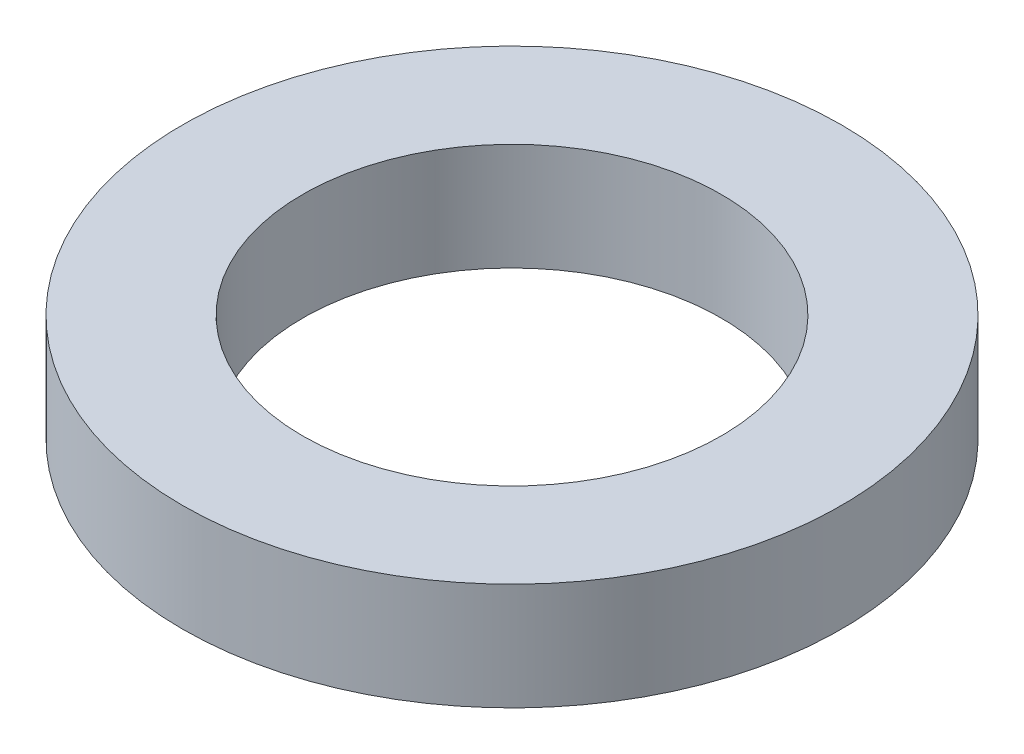
ISO-10303-21;
HEADER;
FILE_DESCRIPTION(('STEP AP214'),'2;1');
FILE_NAME('part.step','',(''),(''),'','','');
FILE_SCHEMA(('AUTOMOTIVE_DESIGN { 1 0 10303 214 1 1 1 1 }'));
ENDSEC;
DATA;
#1=APPLICATION_CONTEXT('core data for automotive mechanical design processes');
#2=APPLICATION_PROTOCOL_DEFINITION('international standard','automotive_design',2000,#1);
#3=PRODUCT_CONTEXT('',#1,'mechanical');
#4=PRODUCT('Part','Part','',(#3));
#5=PRODUCT_RELATED_PRODUCT_CATEGORY('part','',(#4));
#6=PRODUCT_DEFINITION_FORMATION('','',#4);
#7=PRODUCT_DEFINITION_CONTEXT('part definition',#1,'design');
#8=PRODUCT_DEFINITION('design','',#6,#7);
#9=PRODUCT_DEFINITION_SHAPE('','',#8);
#10=(LENGTH_UNIT() NAMED_UNIT(*) SI_UNIT(.MILLI.,.METRE.));
#11=(NAMED_UNIT(*) PLANE_ANGLE_UNIT() SI_UNIT($,.RADIAN.));
#12=(NAMED_UNIT(*) SI_UNIT($,.STERADIAN.) SOLID_ANGLE_UNIT());
#13=UNCERTAINTY_MEASURE_WITH_UNIT(LENGTH_MEASURE(1.E-05),#10,'distance_accuracy_value','');
#14=(GEOMETRIC_REPRESENTATION_CONTEXT(3) GLOBAL_UNCERTAINTY_ASSIGNED_CONTEXT((#13)) GLOBAL_UNIT_ASSIGNED_CONTEXT((#10,
#11,#12)) REPRESENTATION_CONTEXT('',''));
#15=CARTESIAN_POINT('',(0.,0.,0.));
#16=DIRECTION('',(0.,0.,1.));
#17=DIRECTION('',(1.,0.,0.));
#18=AXIS2_PLACEMENT_3D('',#15,#16,#17);
#19=CARTESIAN_POINT('',(0.,0.8128,0.));
#20=DIRECTION('',(0.,1.,0.));
#21=DIRECTION('',(0.,0.,1.));
#22=AXIS2_PLACEMENT_3D('',#19,#20,#21);
#23=PLANE('',#22);
#24=CARTESIAN_POINT('',(0.,0.8128,0.));
#25=DIRECTION('',(0.,1.,0.));
#26=DIRECTION('',(0.,0.,1.));
#27=AXIS2_PLACEMENT_3D('',#24,#25,#26);
#28=CIRCLE('',#27,2.5);
#29=CARTESIAN_POINT('',(0.,0.8128,2.5));
#30=VERTEX_POINT('',#29);
#31=EDGE_CURVE('E10',#30,#30,#28,.T.);
#32=ORIENTED_EDGE('',*,*,#31,.T.);
#33=EDGE_LOOP('',(#32));
#34=FACE_BOUND('',#33,.T.);
#35=CARTESIAN_POINT('',(0.,0.8128,0.));
#36=DIRECTION('',(0.,1.,0.));
#37=DIRECTION('',(0.,0.,1.));
#38=AXIS2_PLACEMENT_3D('',#35,#36,#37);
#39=CIRCLE('',#38,1.5875);
#40=CARTESIAN_POINT('',(0.,0.8128,1.5875));
#41=VERTEX_POINT('',#40);
#42=EDGE_CURVE('E41',#41,#41,#39,.T.);
#43=ORIENTED_EDGE('',*,*,#42,.F.);
#44=EDGE_LOOP('',(#43));
#45=FACE_BOUND('',#44,.T.);
#46=ADVANCED_FACE('F30',(#34,#45),#23,.T.);
#47=CARTESIAN_POINT('',(0.,0.,0.));
#48=DIRECTION('',(0.,1.,0.));
#49=DIRECTION('',(0.,0.,1.));
#50=AXIS2_PLACEMENT_3D('',#47,#48,#49);
#51=PLANE('',#50);
#52=CARTESIAN_POINT('',(0.,0.,0.));
#53=DIRECTION('',(0.,1.,0.));
#54=DIRECTION('',(0.,0.,1.));
#55=AXIS2_PLACEMENT_3D('',#52,#53,#54);
#56=CIRCLE('',#55,2.5);
#57=CARTESIAN_POINT('',(0.,0.,2.5));
#58=VERTEX_POINT('',#57);
#59=EDGE_CURVE('E34',#58,#58,#56,.T.);
#60=ORIENTED_EDGE('',*,*,#59,.F.);
#61=EDGE_LOOP('',(#60));
#62=FACE_BOUND('',#61,.T.);
#63=CARTESIAN_POINT('',(0.,0.,0.));
#64=DIRECTION('',(0.,1.,0.));
#65=DIRECTION('',(0.,0.,1.));
#66=AXIS2_PLACEMENT_3D('',#63,#64,#65);
#67=CIRCLE('',#66,1.5875);
#68=CARTESIAN_POINT('',(0.,0.,1.5875));
#69=VERTEX_POINT('',#68);
#70=EDGE_CURVE('E43',#69,#69,#67,.T.);
#71=ORIENTED_EDGE('',*,*,#70,.T.);
#72=EDGE_LOOP('',(#71));
#73=FACE_BOUND('',#72,.T.);
#74=ADVANCED_FACE('F53',(#62,#73),#51,.F.);
#75=CARTESIAN_POINT('',(0.,0.8128,0.));
#76=DIRECTION('',(0.,-1.,0.));
#77=DIRECTION('',(0.,0.,-1.));
#78=AXIS2_PLACEMENT_3D('',#75,#76,#77);
#79=CYLINDRICAL_SURFACE('',#78,2.5);
#80=ORIENTED_EDGE('',*,*,#31,.F.);
#81=EDGE_LOOP('',(#80));
#82=FACE_BOUND('',#81,.T.);
#83=ORIENTED_EDGE('',*,*,#59,.T.);
#84=EDGE_LOOP('',(#83));
#85=FACE_BOUND('',#84,.T.);
#86=ADVANCED_FACE('F32',(#82,#85),#79,.T.);
#87=CARTESIAN_POINT('',(0.,0.8128,0.));
#88=DIRECTION('',(0.,-1.,0.));
#89=DIRECTION('',(0.,0.,-1.));
#90=AXIS2_PLACEMENT_3D('',#87,#88,#89);
#91=CYLINDRICAL_SURFACE('',#90,1.5875);
#92=ORIENTED_EDGE('',*,*,#42,.T.);
#93=EDGE_LOOP('',(#92));
#94=FACE_BOUND('',#93,.T.);
#95=ORIENTED_EDGE('',*,*,#70,.F.);
#96=EDGE_LOOP('',(#95));
#97=FACE_BOUND('',#96,.T.);
#98=ADVANCED_FACE('F49',(#94,#97),#91,.F.);
#99=CLOSED_SHELL('',(#46,#74,#86,#98));
#100=MANIFOLD_SOLID_BREP('B2',#99);
#101=ADVANCED_BREP_SHAPE_REPRESENTATION('',(#18,#100),#14);
#102=SHAPE_DEFINITION_REPRESENTATION(#9,#101);
ENDSEC;
END-ISO-10303-21;
